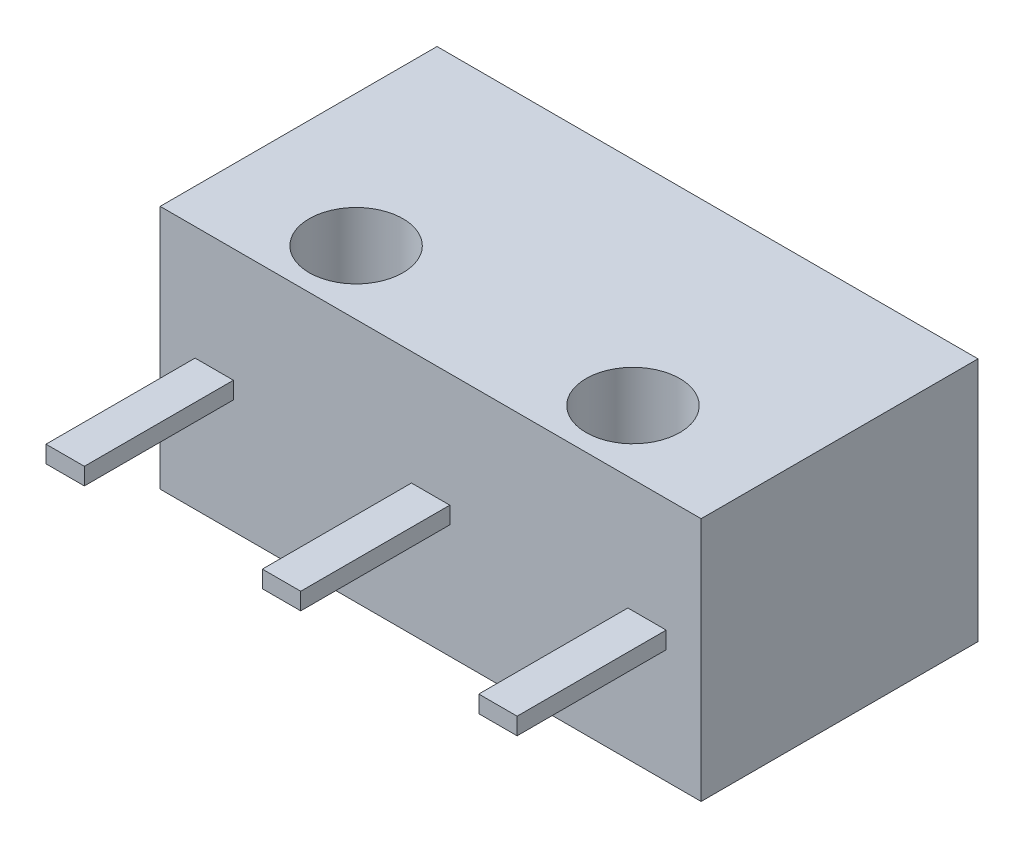
ISO-10303-21;
HEADER;
FILE_DESCRIPTION(('STEP AP214'),'2;1');
FILE_NAME('part.step','',(''),(''),'','','');
FILE_SCHEMA(('AUTOMOTIVE_DESIGN { 1 0 10303 214 1 1 1 1 }'));
ENDSEC;
DATA;
#1=APPLICATION_CONTEXT('core data for automotive mechanical design processes');
#2=APPLICATION_PROTOCOL_DEFINITION('international standard','automotive_design',2000,#1);
#3=PRODUCT_CONTEXT('',#1,'mechanical');
#4=PRODUCT('Part','Part','',(#3));
#5=PRODUCT_RELATED_PRODUCT_CATEGORY('part','',(#4));
#6=PRODUCT_DEFINITION_FORMATION('','',#4);
#7=PRODUCT_DEFINITION_CONTEXT('part definition',#1,'design');
#8=PRODUCT_DEFINITION('design','',#6,#7);
#9=PRODUCT_DEFINITION_SHAPE('','',#8);
#10=(LENGTH_UNIT() NAMED_UNIT(*) SI_UNIT(.MILLI.,.METRE.));
#11=(NAMED_UNIT(*) PLANE_ANGLE_UNIT() SI_UNIT($,.RADIAN.));
#12=(NAMED_UNIT(*) SI_UNIT($,.STERADIAN.) SOLID_ANGLE_UNIT());
#13=UNCERTAINTY_MEASURE_WITH_UNIT(LENGTH_MEASURE(1.E-05),#10,'distance_accuracy_value','');
#14=(GEOMETRIC_REPRESENTATION_CONTEXT(3) GLOBAL_UNCERTAINTY_ASSIGNED_CONTEXT((#13)) GLOBAL_UNIT_ASSIGNED_CONTEXT((#10,
#11,#12)) REPRESENTATION_CONTEXT('',''));
#15=CARTESIAN_POINT('',(0.,0.,0.));
#16=DIRECTION('',(0.,0.,1.));
#17=DIRECTION('',(1.,0.,0.));
#18=AXIS2_PLACEMENT_3D('',#15,#16,#17);
#19=CARTESIAN_POINT('',(0.,5.75,0.));
#20=DIRECTION('',(0.,0.,-1.));
#21=DIRECTION('',(-1.,0.,0.));
#22=AXIS2_PLACEMENT_3D('',#19,#20,#21);
#23=PLANE('',#22);
#24=DIRECTION('',(1.,0.,0.));
#25=VECTOR('',#24,1.);
#26=CARTESIAN_POINT('',(0.,0.,0.));
#27=LINE('',#26,#25);
#28=CARTESIAN_POINT('',(0.,0.,0.));
#29=VERTEX_POINT('',#28);
#30=CARTESIAN_POINT('',(12.7,0.,0.));
#31=VERTEX_POINT('',#30);
#32=EDGE_CURVE('E297',#29,#31,#27,.T.);
#33=ORIENTED_EDGE('',*,*,#32,.T.);
#34=DIRECTION('',(0.,-1.,0.));
#35=VECTOR('',#34,1.);
#36=CARTESIAN_POINT('',(12.7,5.75,0.));
#37=LINE('',#36,#35);
#38=CARTESIAN_POINT('',(12.7,5.75,0.));
#39=VERTEX_POINT('',#38);
#40=EDGE_CURVE('E44',#39,#31,#37,.T.);
#41=ORIENTED_EDGE('',*,*,#40,.F.);
#42=DIRECTION('',(1.,0.,0.));
#43=VECTOR('',#42,1.);
#44=CARTESIAN_POINT('',(0.,5.75,0.));
#45=LINE('',#44,#43);
#46=CARTESIAN_POINT('',(0.,5.75,0.));
#47=VERTEX_POINT('',#46);
#48=EDGE_CURVE('E287',#47,#39,#45,.T.);
#49=ORIENTED_EDGE('',*,*,#48,.F.);
#50=DIRECTION('',(0.,-1.,0.));
#51=VECTOR('',#50,1.);
#52=CARTESIAN_POINT('',(0.,5.75,0.));
#53=LINE('',#52,#51);
#54=EDGE_CURVE('E11',#47,#29,#53,.T.);
#55=ORIENTED_EDGE('',*,*,#54,.T.);
#56=EDGE_LOOP('',(#33,#41,#49,#55));
#57=FACE_BOUND('',#56,.T.);
#58=DIRECTION('',(0.,1.,0.));
#59=VECTOR('',#58,1.);
#60=CARTESIAN_POINT('',(6.8,2.675,0.));
#61=LINE('',#60,#59);
#62=CARTESIAN_POINT('',(6.8,2.675,0.));
#63=VERTEX_POINT('',#62);
#64=CARTESIAN_POINT('',(6.8,3.075,0.));
#65=VERTEX_POINT('',#64);
#66=EDGE_CURVE('E266',#63,#65,#61,.T.);
#67=ORIENTED_EDGE('',*,*,#66,.F.);
#68=DIRECTION('',(-1.,0.,0.));
#69=VECTOR('',#68,1.);
#70=CARTESIAN_POINT('',(5.9,2.675,0.));
#71=LINE('',#70,#69);
#72=CARTESIAN_POINT('',(5.9,2.675,0.));
#73=VERTEX_POINT('',#72);
#74=EDGE_CURVE('E260',#63,#73,#71,.T.);
#75=ORIENTED_EDGE('',*,*,#74,.T.);
#76=DIRECTION('',(0.,1.,0.));
#77=VECTOR('',#76,1.);
#78=CARTESIAN_POINT('',(5.9,2.675,0.));
#79=LINE('',#78,#77);
#80=CARTESIAN_POINT('',(5.9,3.075,0.));
#81=VERTEX_POINT('',#80);
#82=EDGE_CURVE('E263',#73,#81,#79,.T.);
#83=ORIENTED_EDGE('',*,*,#82,.T.);
#84=DIRECTION('',(-1.,0.,0.));
#85=VECTOR('',#84,1.);
#86=CARTESIAN_POINT('',(5.9,3.075,0.));
#87=LINE('',#86,#85);
#88=EDGE_CURVE('E248',#65,#81,#87,.T.);
#89=ORIENTED_EDGE('',*,*,#88,.F.);
#90=EDGE_LOOP('',(#67,#75,#83,#89));
#91=FACE_BOUND('',#90,.T.);
#92=DIRECTION('',(0.,1.,0.));
#93=VECTOR('',#92,1.);
#94=CARTESIAN_POINT('',(11.88,2.675,0.));
#95=LINE('',#94,#93);
#96=CARTESIAN_POINT('',(11.88,2.675,0.));
#97=VERTEX_POINT('',#96);
#98=CARTESIAN_POINT('',(11.88,3.075,0.));
#99=VERTEX_POINT('',#98);
#100=EDGE_CURVE('E236',#97,#99,#95,.T.);
#101=ORIENTED_EDGE('',*,*,#100,.F.);
#102=DIRECTION('',(-1.,0.,0.));
#103=VECTOR('',#102,1.);
#104=CARTESIAN_POINT('',(11.88,2.675,0.));
#105=LINE('',#104,#103);
#106=CARTESIAN_POINT('',(10.98,2.675,0.));
#107=VERTEX_POINT('',#106);
#108=EDGE_CURVE('E225',#97,#107,#105,.T.);
#109=ORIENTED_EDGE('',*,*,#108,.T.);
#110=DIRECTION('',(0.,1.,0.));
#111=VECTOR('',#110,1.);
#112=CARTESIAN_POINT('',(10.98,2.675,0.));
#113=LINE('',#112,#111);
#114=CARTESIAN_POINT('',(10.98,3.075,0.));
#115=VERTEX_POINT('',#114);
#116=EDGE_CURVE('E234',#107,#115,#113,.T.);
#117=ORIENTED_EDGE('',*,*,#116,.T.);
#118=DIRECTION('',(-1.,0.,0.));
#119=VECTOR('',#118,1.);
#120=CARTESIAN_POINT('',(11.88,3.075,0.));
#121=LINE('',#120,#119);
#122=EDGE_CURVE('E214',#99,#115,#121,.T.);
#123=ORIENTED_EDGE('',*,*,#122,.F.);
#124=EDGE_LOOP('',(#101,#109,#117,#123));
#125=FACE_BOUND('',#124,.T.);
#126=DIRECTION('',(-1.,0.,0.));
#127=VECTOR('',#126,1.);
#128=CARTESIAN_POINT('',(0.820000000000001,2.675,0.));
#129=LINE('',#128,#127);
#130=CARTESIAN_POINT('',(1.72,2.675,0.));
#131=VERTEX_POINT('',#130);
#132=CARTESIAN_POINT('',(0.820000000000001,2.675,0.));
#133=VERTEX_POINT('',#132);
#134=EDGE_CURVE('E195',#131,#133,#129,.T.);
#135=ORIENTED_EDGE('',*,*,#134,.T.);
#136=DIRECTION('',(0.,1.,0.));
#137=VECTOR('',#136,1.);
#138=CARTESIAN_POINT('',(0.820000000000001,2.675,0.));
#139=LINE('',#138,#137);
#140=CARTESIAN_POINT('',(0.820000000000001,3.075,0.));
#141=VERTEX_POINT('',#140);
#142=EDGE_CURVE('E199',#133,#141,#139,.T.);
#143=ORIENTED_EDGE('',*,*,#142,.T.);
#144=DIRECTION('',(-1.,0.,0.));
#145=VECTOR('',#144,1.);
#146=CARTESIAN_POINT('',(0.820000000000001,3.075,0.));
#147=LINE('',#146,#145);
#148=CARTESIAN_POINT('',(1.72,3.075,0.));
#149=VERTEX_POINT('',#148);
#150=EDGE_CURVE('E186',#149,#141,#147,.T.);
#151=ORIENTED_EDGE('',*,*,#150,.F.);
#152=DIRECTION('',(0.,1.,0.));
#153=VECTOR('',#152,1.);
#154=CARTESIAN_POINT('',(1.72,2.675,0.));
#155=LINE('',#154,#153);
#156=EDGE_CURVE('E203',#131,#149,#155,.T.);
#157=ORIENTED_EDGE('',*,*,#156,.F.);
#158=EDGE_LOOP('',(#135,#143,#151,#157));
#159=FACE_BOUND('',#158,.T.);
#160=ADVANCED_FACE('F36',(#57,#91,#125,#159),#23,.F.);
#161=CARTESIAN_POINT('',(0.,5.75,0.));
#162=DIRECTION('',(1.,0.,0.));
#163=DIRECTION('',(0.,0.,-1.));
#164=AXIS2_PLACEMENT_3D('',#161,#162,#163);
#165=PLANE('',#164);
#166=DIRECTION('',(0.,0.,1.));
#167=VECTOR('',#166,1.);
#168=CARTESIAN_POINT('',(0.,0.,0.));
#169=LINE('',#168,#167);
#170=CARTESIAN_POINT('',(0.,0.,-6.5));
#171=VERTEX_POINT('',#170);
#172=EDGE_CURVE('E275',#171,#29,#169,.T.);
#173=ORIENTED_EDGE('',*,*,#172,.T.);
#174=ORIENTED_EDGE('',*,*,#54,.F.);
#175=DIRECTION('',(0.,0.,1.));
#176=VECTOR('',#175,1.);
#177=CARTESIAN_POINT('',(0.,5.75,0.));
#178=LINE('',#177,#176);
#179=CARTESIAN_POINT('',(0.,5.75,-6.5));
#180=VERTEX_POINT('',#179);
#181=EDGE_CURVE('E284',#180,#47,#178,.T.);
#182=ORIENTED_EDGE('',*,*,#181,.F.);
#183=DIRECTION('',(0.,-1.,0.));
#184=VECTOR('',#183,1.);
#185=CARTESIAN_POINT('',(0.,5.75,-6.5));
#186=LINE('',#185,#184);
#187=EDGE_CURVE('E294',#180,#171,#186,.T.);
#188=ORIENTED_EDGE('',*,*,#187,.T.);
#189=EDGE_LOOP('',(#173,#174,#182,#188));
#190=FACE_BOUND('',#189,.T.);
#191=ADVANCED_FACE('F38',(#190),#165,.F.);
#192=CARTESIAN_POINT('',(12.7,5.75,0.));
#193=DIRECTION('',(-1.,0.,0.));
#194=DIRECTION('',(0.,0.,1.));
#195=AXIS2_PLACEMENT_3D('',#192,#193,#194);
#196=PLANE('',#195);
#197=DIRECTION('',(0.,0.,-1.));
#198=VECTOR('',#197,1.);
#199=CARTESIAN_POINT('',(12.7,0.,0.));
#200=LINE('',#199,#198);
#201=CARTESIAN_POINT('',(12.7,0.,-6.5));
#202=VERTEX_POINT('',#201);
#203=EDGE_CURVE('E299',#31,#202,#200,.T.);
#204=ORIENTED_EDGE('',*,*,#203,.T.);
#205=DIRECTION('',(0.,-1.,0.));
#206=VECTOR('',#205,1.);
#207=CARTESIAN_POINT('',(12.7,5.75,-6.5));
#208=LINE('',#207,#206);
#209=CARTESIAN_POINT('',(12.7,5.75,-6.5));
#210=VERTEX_POINT('',#209);
#211=EDGE_CURVE('E304',#210,#202,#208,.T.);
#212=ORIENTED_EDGE('',*,*,#211,.F.);
#213=DIRECTION('',(0.,0.,-1.));
#214=VECTOR('',#213,1.);
#215=CARTESIAN_POINT('',(12.7,5.75,0.));
#216=LINE('',#215,#214);
#217=EDGE_CURVE('E290',#39,#210,#216,.T.);
#218=ORIENTED_EDGE('',*,*,#217,.F.);
#219=ORIENTED_EDGE('',*,*,#40,.T.);
#220=EDGE_LOOP('',(#204,#212,#218,#219));
#221=FACE_BOUND('',#220,.T.);
#222=ADVANCED_FACE('F311',(#221),#196,.F.);
#223=CARTESIAN_POINT('',(0.,5.75,-6.5));
#224=DIRECTION('',(0.,0.,1.));
#225=DIRECTION('',(1.,0.,0.));
#226=AXIS2_PLACEMENT_3D('',#223,#224,#225);
#227=PLANE('',#226);
#228=DIRECTION('',(0.,1.,0.));
#229=VECTOR('',#228,1.);
#230=CARTESIAN_POINT('',(3.8,1.425,-6.5));
#231=LINE('',#230,#229);
#232=CARTESIAN_POINT('',(3.8,1.425,-6.5));
#233=VERTEX_POINT('',#232);
#234=CARTESIAN_POINT('',(3.8,4.325,-6.5));
#235=VERTEX_POINT('',#234);
#236=EDGE_CURVE('E56',#233,#235,#231,.T.);
#237=ORIENTED_EDGE('',*,*,#236,.F.);
#238=DIRECTION('',(1.,0.,0.));
#239=VECTOR('',#238,1.);
#240=CARTESIAN_POINT('',(3.8,1.425,-6.5));
#241=LINE('',#240,#239);
#242=CARTESIAN_POINT('',(5.,1.425,-6.5));
#243=VERTEX_POINT('',#242);
#244=EDGE_CURVE('E51',#233,#243,#241,.T.);
#245=ORIENTED_EDGE('',*,*,#244,.T.);
#246=DIRECTION('',(0.,1.,0.));
#247=VECTOR('',#246,1.);
#248=CARTESIAN_POINT('',(5.,1.425,-6.5));
#249=LINE('',#248,#247);
#250=CARTESIAN_POINT('',(5.,4.325,-6.5));
#251=VERTEX_POINT('',#250);
#252=EDGE_CURVE('E157',#243,#251,#249,.T.);
#253=ORIENTED_EDGE('',*,*,#252,.T.);
#254=DIRECTION('',(1.,0.,0.));
#255=VECTOR('',#254,1.);
#256=CARTESIAN_POINT('',(3.8,4.325,-6.5));
#257=LINE('',#256,#255);
#258=EDGE_CURVE('E161',#235,#251,#257,.T.);
#259=ORIENTED_EDGE('',*,*,#258,.F.);
#260=EDGE_LOOP('',(#237,#245,#253,#259));
#261=FACE_BOUND('',#260,.T.);
#262=DIRECTION('',(-1.,0.,0.));
#263=VECTOR('',#262,1.);
#264=CARTESIAN_POINT('',(0.,0.,-6.5));
#265=LINE('',#264,#263);
#266=EDGE_CURVE('E288',#202,#171,#265,.T.);
#267=ORIENTED_EDGE('',*,*,#266,.T.);
#268=ORIENTED_EDGE('',*,*,#187,.F.);
#269=DIRECTION('',(-1.,0.,0.));
#270=VECTOR('',#269,1.);
#271=CARTESIAN_POINT('',(0.,5.75,-6.5));
#272=LINE('',#271,#270);
#273=EDGE_CURVE('E292',#210,#180,#272,.T.);
#274=ORIENTED_EDGE('',*,*,#273,.F.);
#275=ORIENTED_EDGE('',*,*,#211,.T.);
#276=EDGE_LOOP('',(#267,#268,#274,#275));
#277=FACE_BOUND('',#276,.T.);
#278=ADVANCED_FACE('F159',(#261,#277),#227,.F.);
#279=CARTESIAN_POINT('',(0.,5.75,0.));
#280=DIRECTION('',(0.,-1.,0.));
#281=DIRECTION('',(0.,0.,-1.));
#282=AXIS2_PLACEMENT_3D('',#279,#280,#281);
#283=PLANE('',#282);
#284=CARTESIAN_POINT('',(3.1,5.75,-1.5));
#285=DIRECTION('',(0.,1.,0.));
#286=DIRECTION('',(0.,0.,1.));
#287=AXIS2_PLACEMENT_3D('',#284,#285,#286);
#288=CIRCLE('',#287,1.1);
#289=CARTESIAN_POINT('',(3.1,5.75,-0.4));
#290=VERTEX_POINT('',#289);
#291=EDGE_CURVE('E276',#290,#290,#288,.T.);
#292=ORIENTED_EDGE('',*,*,#291,.F.);
#293=EDGE_LOOP('',(#292));
#294=FACE_BOUND('',#293,.T.);
#295=CARTESIAN_POINT('',(9.6,5.75,-1.5));
#296=DIRECTION('',(0.,1.,0.));
#297=DIRECTION('',(0.,0.,1.));
#298=AXIS2_PLACEMENT_3D('',#295,#296,#297);
#299=CIRCLE('',#298,1.1);
#300=CARTESIAN_POINT('',(9.6,5.75,-0.4));
#301=VERTEX_POINT('',#300);
#302=EDGE_CURVE('E265',#301,#301,#299,.T.);
#303=ORIENTED_EDGE('',*,*,#302,.F.);
#304=EDGE_LOOP('',(#303));
#305=FACE_BOUND('',#304,.T.);
#306=ORIENTED_EDGE('',*,*,#181,.T.);
#307=ORIENTED_EDGE('',*,*,#48,.T.);
#308=ORIENTED_EDGE('',*,*,#217,.T.);
#309=ORIENTED_EDGE('',*,*,#273,.T.);
#310=EDGE_LOOP('',(#306,#307,#308,#309));
#311=FACE_BOUND('',#310,.T.);
#312=ADVANCED_FACE('F324',(#294,#305,#311),#283,.F.);
#313=CARTESIAN_POINT('',(0.,0.,0.));
#314=DIRECTION('',(0.,-1.,0.));
#315=DIRECTION('',(0.,0.,-1.));
#316=AXIS2_PLACEMENT_3D('',#313,#314,#315);
#317=PLANE('',#316);
#318=CARTESIAN_POINT('',(3.1,0.,-1.5));
#319=DIRECTION('',(0.,1.,0.));
#320=DIRECTION('',(0.,0.,1.));
#321=AXIS2_PLACEMENT_3D('',#318,#319,#320);
#322=CIRCLE('',#321,1.1);
#323=CARTESIAN_POINT('',(3.1,0.,-0.4));
#324=VERTEX_POINT('',#323);
#325=EDGE_CURVE('E272',#324,#324,#322,.T.);
#326=ORIENTED_EDGE('',*,*,#325,.T.);
#327=EDGE_LOOP('',(#326));
#328=FACE_BOUND('',#327,.T.);
#329=CARTESIAN_POINT('',(9.6,0.,-1.5));
#330=DIRECTION('',(0.,1.,0.));
#331=DIRECTION('',(0.,0.,1.));
#332=AXIS2_PLACEMENT_3D('',#329,#330,#331);
#333=CIRCLE('',#332,1.1);
#334=CARTESIAN_POINT('',(9.6,0.,-0.4));
#335=VERTEX_POINT('',#334);
#336=EDGE_CURVE('E279',#335,#335,#333,.T.);
#337=ORIENTED_EDGE('',*,*,#336,.T.);
#338=EDGE_LOOP('',(#337));
#339=FACE_BOUND('',#338,.T.);
#340=ORIENTED_EDGE('',*,*,#172,.F.);
#341=ORIENTED_EDGE('',*,*,#266,.F.);
#342=ORIENTED_EDGE('',*,*,#203,.F.);
#343=ORIENTED_EDGE('',*,*,#32,.F.);
#344=EDGE_LOOP('',(#340,#341,#342,#343));
#345=FACE_BOUND('',#344,.T.);
#346=ADVANCED_FACE('F317',(#328,#339,#345),#317,.T.);
#347=CARTESIAN_POINT('',(9.6,0.,-1.5));
#348=DIRECTION('',(0.,1.,0.));
#349=DIRECTION('',(0.,0.,1.));
#350=AXIS2_PLACEMENT_3D('',#347,#348,#349);
#351=CYLINDRICAL_SURFACE('',#350,1.1);
#352=ORIENTED_EDGE('',*,*,#336,.F.);
#353=EDGE_LOOP('',(#352));
#354=FACE_BOUND('',#353,.T.);
#355=ORIENTED_EDGE('',*,*,#302,.T.);
#356=EDGE_LOOP('',(#355));
#357=FACE_BOUND('',#356,.T.);
#358=ADVANCED_FACE('F404',(#354,#357),#351,.F.);
#359=CARTESIAN_POINT('',(3.1,0.,-1.5));
#360=DIRECTION('',(0.,1.,0.));
#361=DIRECTION('',(0.,0.,1.));
#362=AXIS2_PLACEMENT_3D('',#359,#360,#361);
#363=CYLINDRICAL_SURFACE('',#362,1.1);
#364=ORIENTED_EDGE('',*,*,#325,.F.);
#365=EDGE_LOOP('',(#364));
#366=FACE_BOUND('',#365,.T.);
#367=ORIENTED_EDGE('',*,*,#291,.T.);
#368=EDGE_LOOP('',(#367));
#369=FACE_BOUND('',#368,.T.);
#370=ADVANCED_FACE('F400',(#366,#369),#363,.F.);
#371=CARTESIAN_POINT('',(5.9,2.675,3.5));
#372=DIRECTION('',(-1.,0.,0.));
#373=DIRECTION('',(0.,0.,1.));
#374=AXIS2_PLACEMENT_3D('',#371,#372,#373);
#375=PLANE('',#374);
#376=DIRECTION('',(0.,1.,0.));
#377=VECTOR('',#376,1.);
#378=CARTESIAN_POINT('',(5.9,2.675,3.5));
#379=LINE('',#378,#377);
#380=CARTESIAN_POINT('',(5.9,2.675,3.5));
#381=VERTEX_POINT('',#380);
#382=CARTESIAN_POINT('',(5.9,3.075,3.5));
#383=VERTEX_POINT('',#382);
#384=EDGE_CURVE('E262',#381,#383,#379,.T.);
#385=ORIENTED_EDGE('',*,*,#384,.T.);
#386=DIRECTION('',(0.,0.,1.));
#387=VECTOR('',#386,1.);
#388=CARTESIAN_POINT('',(5.9,3.075,3.5));
#389=LINE('',#388,#387);
#390=EDGE_CURVE('E233',#81,#383,#389,.T.);
#391=ORIENTED_EDGE('',*,*,#390,.F.);
#392=ORIENTED_EDGE('',*,*,#82,.F.);
#393=DIRECTION('',(0.,0.,1.));
#394=VECTOR('',#393,1.);
#395=CARTESIAN_POINT('',(5.9,2.675,3.5));
#396=LINE('',#395,#394);
#397=EDGE_CURVE('E251',#73,#381,#396,.T.);
#398=ORIENTED_EDGE('',*,*,#397,.T.);
#399=EDGE_LOOP('',(#385,#391,#392,#398));
#400=FACE_BOUND('',#399,.T.);
#401=ADVANCED_FACE('F393',(#400),#375,.T.);
#402=CARTESIAN_POINT('',(6.8,2.675,3.5));
#403=DIRECTION('',(1.,0.,0.));
#404=DIRECTION('',(0.,0.,-1.));
#405=AXIS2_PLACEMENT_3D('',#402,#403,#404);
#406=PLANE('',#405);
#407=ORIENTED_EDGE('',*,*,#66,.T.);
#408=DIRECTION('',(0.,0.,-1.));
#409=VECTOR('',#408,1.);
#410=CARTESIAN_POINT('',(6.8,3.075,3.5));
#411=LINE('',#410,#409);
#412=CARTESIAN_POINT('',(6.8,3.075,3.5));
#413=VERTEX_POINT('',#412);
#414=EDGE_CURVE('E245',#413,#65,#411,.T.);
#415=ORIENTED_EDGE('',*,*,#414,.F.);
#416=DIRECTION('',(0.,1.,0.));
#417=VECTOR('',#416,1.);
#418=CARTESIAN_POINT('',(6.8,2.675,3.5));
#419=LINE('',#418,#417);
#420=CARTESIAN_POINT('',(6.8,2.675,3.5));
#421=VERTEX_POINT('',#420);
#422=EDGE_CURVE('E269',#421,#413,#419,.T.);
#423=ORIENTED_EDGE('',*,*,#422,.F.);
#424=DIRECTION('',(0.,0.,-1.));
#425=VECTOR('',#424,1.);
#426=CARTESIAN_POINT('',(6.8,2.675,3.5));
#427=LINE('',#426,#425);
#428=EDGE_CURVE('E257',#421,#63,#427,.T.);
#429=ORIENTED_EDGE('',*,*,#428,.T.);
#430=EDGE_LOOP('',(#407,#415,#423,#429));
#431=FACE_BOUND('',#430,.T.);
#432=ADVANCED_FACE('F390',(#431),#406,.T.);
#433=CARTESIAN_POINT('',(5.9,2.675,3.5));
#434=DIRECTION('',(0.,0.,1.));
#435=DIRECTION('',(1.,0.,0.));
#436=AXIS2_PLACEMENT_3D('',#433,#434,#435);
#437=PLANE('',#436);
#438=ORIENTED_EDGE('',*,*,#422,.T.);
#439=DIRECTION('',(1.,0.,0.));
#440=VECTOR('',#439,1.);
#441=CARTESIAN_POINT('',(5.9,3.075,3.5));
#442=LINE('',#441,#440);
#443=EDGE_CURVE('E242',#383,#413,#442,.T.);
#444=ORIENTED_EDGE('',*,*,#443,.F.);
#445=ORIENTED_EDGE('',*,*,#384,.F.);
#446=DIRECTION('',(1.,0.,0.));
#447=VECTOR('',#446,1.);
#448=CARTESIAN_POINT('',(5.9,2.675,3.5));
#449=LINE('',#448,#447);
#450=EDGE_CURVE('E254',#381,#421,#449,.T.);
#451=ORIENTED_EDGE('',*,*,#450,.T.);
#452=EDGE_LOOP('',(#438,#444,#445,#451));
#453=FACE_BOUND('',#452,.T.);
#454=ADVANCED_FACE('F388',(#453),#437,.T.);
#455=CARTESIAN_POINT('',(0.,2.675,0.));
#456=DIRECTION('',(0.,-1.,0.));
#457=DIRECTION('',(0.,0.,-1.));
#458=AXIS2_PLACEMENT_3D('',#455,#456,#457);
#459=PLANE('',#458);
#460=ORIENTED_EDGE('',*,*,#397,.F.);
#461=ORIENTED_EDGE('',*,*,#74,.F.);
#462=ORIENTED_EDGE('',*,*,#428,.F.);
#463=ORIENTED_EDGE('',*,*,#450,.F.);
#464=EDGE_LOOP('',(#460,#461,#462,#463));
#465=FACE_BOUND('',#464,.T.);
#466=ADVANCED_FACE('F384',(#465),#459,.T.);
#467=CARTESIAN_POINT('',(0.,3.075,0.));
#468=DIRECTION('',(0.,-1.,0.));
#469=DIRECTION('',(0.,0.,-1.));
#470=AXIS2_PLACEMENT_3D('',#467,#468,#469);
#471=PLANE('',#470);
#472=ORIENTED_EDGE('',*,*,#390,.T.);
#473=ORIENTED_EDGE('',*,*,#443,.T.);
#474=ORIENTED_EDGE('',*,*,#414,.T.);
#475=ORIENTED_EDGE('',*,*,#88,.T.);
#476=EDGE_LOOP('',(#472,#473,#474,#475));
#477=FACE_BOUND('',#476,.T.);
#478=ADVANCED_FACE('F374',(#477),#471,.F.);
#479=CARTESIAN_POINT('',(10.98,2.675,3.5));
#480=DIRECTION('',(-1.,0.,0.));
#481=DIRECTION('',(0.,0.,1.));
#482=AXIS2_PLACEMENT_3D('',#479,#480,#481);
#483=PLANE('',#482);
#484=DIRECTION('',(0.,1.,0.));
#485=VECTOR('',#484,1.);
#486=CARTESIAN_POINT('',(10.98,2.675,3.5));
#487=LINE('',#486,#485);
#488=CARTESIAN_POINT('',(10.98,2.675,3.5));
#489=VERTEX_POINT('',#488);
#490=CARTESIAN_POINT('',(10.98,3.075,3.5));
#491=VERTEX_POINT('',#490);
#492=EDGE_CURVE('E231',#489,#491,#487,.T.);
#493=ORIENTED_EDGE('',*,*,#492,.T.);
#494=DIRECTION('',(0.,0.,1.));
#495=VECTOR('',#494,1.);
#496=CARTESIAN_POINT('',(10.98,3.075,3.5));
#497=LINE('',#496,#495);
#498=EDGE_CURVE('E217',#115,#491,#497,.T.);
#499=ORIENTED_EDGE('',*,*,#498,.F.);
#500=ORIENTED_EDGE('',*,*,#116,.F.);
#501=DIRECTION('',(0.,0.,1.));
#502=VECTOR('',#501,1.);
#503=CARTESIAN_POINT('',(10.98,2.675,3.5));
#504=LINE('',#503,#502);
#505=EDGE_CURVE('E227',#107,#489,#504,.T.);
#506=ORIENTED_EDGE('',*,*,#505,.T.);
#507=EDGE_LOOP('',(#493,#499,#500,#506));
#508=FACE_BOUND('',#507,.T.);
#509=ADVANCED_FACE('F370',(#508),#483,.T.);
#510=CARTESIAN_POINT('',(11.88,2.675,0.));
#511=DIRECTION('',(1.,0.,0.));
#512=DIRECTION('',(0.,0.,-1.));
#513=AXIS2_PLACEMENT_3D('',#510,#511,#512);
#514=PLANE('',#513);
#515=ORIENTED_EDGE('',*,*,#100,.T.);
#516=DIRECTION('',(0.,0.,-1.));
#517=VECTOR('',#516,1.);
#518=CARTESIAN_POINT('',(11.88,3.075,0.));
#519=LINE('',#518,#517);
#520=CARTESIAN_POINT('',(11.88,3.075,3.5));
#521=VERTEX_POINT('',#520);
#522=EDGE_CURVE('E211',#521,#99,#519,.T.);
#523=ORIENTED_EDGE('',*,*,#522,.F.);
#524=DIRECTION('',(0.,1.,0.));
#525=VECTOR('',#524,1.);
#526=CARTESIAN_POINT('',(11.88,2.675,3.5));
#527=LINE('',#526,#525);
#528=CARTESIAN_POINT('',(11.88,2.675,3.5));
#529=VERTEX_POINT('',#528);
#530=EDGE_CURVE('E230',#529,#521,#527,.T.);
#531=ORIENTED_EDGE('',*,*,#530,.F.);
#532=DIRECTION('',(0.,0.,-1.));
#533=VECTOR('',#532,1.);
#534=CARTESIAN_POINT('',(11.88,2.675,0.));
#535=LINE('',#534,#533);
#536=EDGE_CURVE('E222',#529,#97,#535,.T.);
#537=ORIENTED_EDGE('',*,*,#536,.T.);
#538=EDGE_LOOP('',(#515,#523,#531,#537));
#539=FACE_BOUND('',#538,.T.);
#540=ADVANCED_FACE('F373',(#539),#514,.T.);
#541=CARTESIAN_POINT('',(11.88,2.675,3.5));
#542=DIRECTION('',(0.,0.,1.));
#543=DIRECTION('',(1.,0.,0.));
#544=AXIS2_PLACEMENT_3D('',#541,#542,#543);
#545=PLANE('',#544);
#546=ORIENTED_EDGE('',*,*,#530,.T.);
#547=DIRECTION('',(1.,0.,0.));
#548=VECTOR('',#547,1.);
#549=CARTESIAN_POINT('',(11.43,3.075,3.5));
#550=LINE('',#549,#548);
#551=EDGE_CURVE('E202',#491,#521,#550,.T.);
#552=ORIENTED_EDGE('',*,*,#551,.F.);
#553=ORIENTED_EDGE('',*,*,#492,.F.);
#554=DIRECTION('',(1.,0.,0.));
#555=VECTOR('',#554,1.);
#556=CARTESIAN_POINT('',(11.43,2.675,3.5));
#557=LINE('',#556,#555);
#558=EDGE_CURVE('E220',#489,#529,#557,.T.);
#559=ORIENTED_EDGE('',*,*,#558,.T.);
#560=EDGE_LOOP('',(#546,#552,#553,#559));
#561=FACE_BOUND('',#560,.T.);
#562=ADVANCED_FACE('F368',(#561),#545,.T.);
#563=CARTESIAN_POINT('',(0.,2.675,0.));
#564=DIRECTION('',(0.,-1.,0.));
#565=DIRECTION('',(0.,0.,-1.));
#566=AXIS2_PLACEMENT_3D('',#563,#564,#565);
#567=PLANE('',#566);
#568=ORIENTED_EDGE('',*,*,#558,.F.);
#569=ORIENTED_EDGE('',*,*,#505,.F.);
#570=ORIENTED_EDGE('',*,*,#108,.F.);
#571=ORIENTED_EDGE('',*,*,#536,.F.);
#572=EDGE_LOOP('',(#568,#569,#570,#571));
#573=FACE_BOUND('',#572,.T.);
#574=ADVANCED_FACE('F364',(#573),#567,.T.);
#575=CARTESIAN_POINT('',(0.,3.075,0.));
#576=DIRECTION('',(0.,-1.,0.));
#577=DIRECTION('',(0.,0.,-1.));
#578=AXIS2_PLACEMENT_3D('',#575,#576,#577);
#579=PLANE('',#578);
#580=ORIENTED_EDGE('',*,*,#551,.T.);
#581=ORIENTED_EDGE('',*,*,#522,.T.);
#582=ORIENTED_EDGE('',*,*,#122,.T.);
#583=ORIENTED_EDGE('',*,*,#498,.T.);
#584=EDGE_LOOP('',(#580,#581,#582,#583));
#585=FACE_BOUND('',#584,.T.);
#586=ADVANCED_FACE('F361',(#585),#579,.F.);
#587=CARTESIAN_POINT('',(0.820000000000001,2.675,0.));
#588=DIRECTION('',(-1.,0.,0.));
#589=DIRECTION('',(0.,0.,1.));
#590=AXIS2_PLACEMENT_3D('',#587,#588,#589);
#591=PLANE('',#590);
#592=DIRECTION('',(0.,1.,0.));
#593=VECTOR('',#592,1.);
#594=CARTESIAN_POINT('',(0.820000000000001,2.675,3.5));
#595=LINE('',#594,#593);
#596=CARTESIAN_POINT('',(0.820000000000001,2.675,3.5));
#597=VERTEX_POINT('',#596);
#598=CARTESIAN_POINT('',(0.820000000000001,3.075,3.5));
#599=VERTEX_POINT('',#598);
#600=EDGE_CURVE('E198',#597,#599,#595,.T.);
#601=ORIENTED_EDGE('',*,*,#600,.T.);
#602=DIRECTION('',(0.,0.,1.));
#603=VECTOR('',#602,1.);
#604=CARTESIAN_POINT('',(0.820000000000001,3.075,0.));
#605=LINE('',#604,#603);
#606=EDGE_CURVE('E165',#141,#599,#605,.T.);
#607=ORIENTED_EDGE('',*,*,#606,.F.);
#608=ORIENTED_EDGE('',*,*,#142,.F.);
#609=DIRECTION('',(0.,0.,1.));
#610=VECTOR('',#609,1.);
#611=CARTESIAN_POINT('',(0.820000000000001,2.675,0.));
#612=LINE('',#611,#610);
#613=EDGE_CURVE('E188',#133,#597,#612,.T.);
#614=ORIENTED_EDGE('',*,*,#613,.T.);
#615=EDGE_LOOP('',(#601,#607,#608,#614));
#616=FACE_BOUND('',#615,.T.);
#617=ADVANCED_FACE('F339',(#616),#591,.T.);
#618=CARTESIAN_POINT('',(1.72,2.675,3.5));
#619=DIRECTION('',(1.,0.,0.));
#620=DIRECTION('',(0.,0.,-1.));
#621=AXIS2_PLACEMENT_3D('',#618,#619,#620);
#622=PLANE('',#621);
#623=ORIENTED_EDGE('',*,*,#156,.T.);
#624=DIRECTION('',(0.,0.,-1.));
#625=VECTOR('',#624,1.);
#626=CARTESIAN_POINT('',(1.72,3.075,3.5));
#627=LINE('',#626,#625);
#628=CARTESIAN_POINT('',(1.72,3.075,3.5));
#629=VERTEX_POINT('',#628);
#630=EDGE_CURVE('E184',#629,#149,#627,.T.);
#631=ORIENTED_EDGE('',*,*,#630,.F.);
#632=DIRECTION('',(0.,1.,0.));
#633=VECTOR('',#632,1.);
#634=CARTESIAN_POINT('',(1.72,2.675,3.5));
#635=LINE('',#634,#633);
#636=CARTESIAN_POINT('',(1.72,2.675,3.5));
#637=VERTEX_POINT('',#636);
#638=EDGE_CURVE('E206',#637,#629,#635,.T.);
#639=ORIENTED_EDGE('',*,*,#638,.F.);
#640=DIRECTION('',(0.,0.,-1.));
#641=VECTOR('',#640,1.);
#642=CARTESIAN_POINT('',(1.72,2.675,3.5));
#643=LINE('',#642,#641);
#644=EDGE_CURVE('E193',#637,#131,#643,.T.);
#645=ORIENTED_EDGE('',*,*,#644,.T.);
#646=EDGE_LOOP('',(#623,#631,#639,#645));
#647=FACE_BOUND('',#646,.T.);
#648=ADVANCED_FACE('F347',(#647),#622,.T.);
#649=CARTESIAN_POINT('',(1.27,2.675,3.5));
#650=DIRECTION('',(0.,0.,1.));
#651=DIRECTION('',(1.,0.,0.));
#652=AXIS2_PLACEMENT_3D('',#649,#650,#651);
#653=PLANE('',#652);
#654=ORIENTED_EDGE('',*,*,#638,.T.);
#655=DIRECTION('',(1.,0.,0.));
#656=VECTOR('',#655,1.);
#657=CARTESIAN_POINT('',(0.820000000000001,3.075,3.5));
#658=LINE('',#657,#656);
#659=EDGE_CURVE('E181',#599,#629,#658,.T.);
#660=ORIENTED_EDGE('',*,*,#659,.F.);
#661=ORIENTED_EDGE('',*,*,#600,.F.);
#662=DIRECTION('',(1.,0.,0.));
#663=VECTOR('',#662,1.);
#664=CARTESIAN_POINT('',(0.820000000000001,2.675,3.5));
#665=LINE('',#664,#663);
#666=EDGE_CURVE('E191',#597,#637,#665,.T.);
#667=ORIENTED_EDGE('',*,*,#666,.T.);
#668=EDGE_LOOP('',(#654,#660,#661,#667));
#669=FACE_BOUND('',#668,.T.);
#670=ADVANCED_FACE('F349',(#669),#653,.T.);
#671=CARTESIAN_POINT('',(0.,2.675,0.));
#672=DIRECTION('',(0.,1.,0.));
#673=DIRECTION('',(0.,0.,1.));
#674=AXIS2_PLACEMENT_3D('',#671,#672,#673);
#675=PLANE('',#674);
#676=ORIENTED_EDGE('',*,*,#613,.F.);
#677=ORIENTED_EDGE('',*,*,#134,.F.);
#678=ORIENTED_EDGE('',*,*,#644,.F.);
#679=ORIENTED_EDGE('',*,*,#666,.F.);
#680=EDGE_LOOP('',(#676,#677,#678,#679));
#681=FACE_BOUND('',#680,.T.);
#682=ADVANCED_FACE('F336',(#681),#675,.F.);
#683=CARTESIAN_POINT('',(0.,3.075,0.));
#684=DIRECTION('',(0.,1.,0.));
#685=DIRECTION('',(0.,0.,1.));
#686=AXIS2_PLACEMENT_3D('',#683,#684,#685);
#687=PLANE('',#686);
#688=ORIENTED_EDGE('',*,*,#606,.T.);
#689=ORIENTED_EDGE('',*,*,#659,.T.);
#690=ORIENTED_EDGE('',*,*,#630,.T.);
#691=ORIENTED_EDGE('',*,*,#150,.T.);
#692=EDGE_LOOP('',(#688,#689,#690,#691));
#693=FACE_BOUND('',#692,.T.);
#694=ADVANCED_FACE('F343',(#693),#687,.T.);
#695=CARTESIAN_POINT('',(4.4,1.425,-6.5));
#696=DIRECTION('',(0.,1.,0.));
#697=DIRECTION('',(0.,0.,1.));
#698=AXIS2_PLACEMENT_3D('',#695,#696,#697);
#699=CYLINDRICAL_SURFACE('',#698,0.6);
#700=ORIENTED_EDGE('',*,*,#236,.T.);
#701=CARTESIAN_POINT('',(4.4,4.325,-6.5));
#702=DIRECTION('',(0.,1.,0.));
#703=DIRECTION('',(0.,0.,-1.));
#704=AXIS2_PLACEMENT_3D('',#701,#702,#703);
#705=CIRCLE('',#704,0.6);
#706=EDGE_CURVE('E170',#251,#235,#705,.T.);
#707=ORIENTED_EDGE('',*,*,#706,.F.);
#708=ORIENTED_EDGE('',*,*,#252,.F.);
#709=CARTESIAN_POINT('',(4.4,1.425,-6.5));
#710=DIRECTION('',(0.,1.,0.));
#711=DIRECTION('',(0.,0.,-1.));
#712=AXIS2_PLACEMENT_3D('',#709,#710,#711);
#713=CIRCLE('',#712,0.6);
#714=EDGE_CURVE('E171',#243,#233,#713,.T.);
#715=ORIENTED_EDGE('',*,*,#714,.T.);
#716=EDGE_LOOP('',(#700,#707,#708,#715));
#717=FACE_BOUND('',#716,.T.);
#718=ADVANCED_FACE('F173',(#717),#699,.T.);
#719=CARTESIAN_POINT('',(4.4,1.425,-6.5));
#720=DIRECTION('',(0.,-1.,0.));
#721=DIRECTION('',(0.,0.,-1.));
#722=AXIS2_PLACEMENT_3D('',#719,#720,#721);
#723=PLANE('',#722);
#724=ORIENTED_EDGE('',*,*,#714,.F.);
#725=ORIENTED_EDGE('',*,*,#244,.F.);
#726=EDGE_LOOP('',(#724,#725));
#727=FACE_BOUND('',#726,.T.);
#728=ADVANCED_FACE('F540',(#727),#723,.T.);
#729=CARTESIAN_POINT('',(4.4,4.325,-6.5));
#730=DIRECTION('',(0.,-1.,0.));
#731=DIRECTION('',(0.,0.,-1.));
#732=AXIS2_PLACEMENT_3D('',#729,#730,#731);
#733=PLANE('',#732);
#734=ORIENTED_EDGE('',*,*,#706,.T.);
#735=ORIENTED_EDGE('',*,*,#258,.T.);
#736=EDGE_LOOP('',(#734,#735));
#737=FACE_BOUND('',#736,.T.);
#738=ADVANCED_FACE('F169',(#737),#733,.F.);
#739=CLOSED_SHELL('',(#160,#191,#222,#278,#312,#346,#358,#370,#401,#432,#454,#466,#478,#509,
#540,#562,#574,#586,#617,#648,#670,#682,#694,#718,#728,#738));
#740=MANIFOLD_SOLID_BREP('B2',#739);
#741=ADVANCED_BREP_SHAPE_REPRESENTATION('',(#18,#740),#14);
#742=SHAPE_DEFINITION_REPRESENTATION(#9,#741);
ENDSEC;
END-ISO-10303-21;
